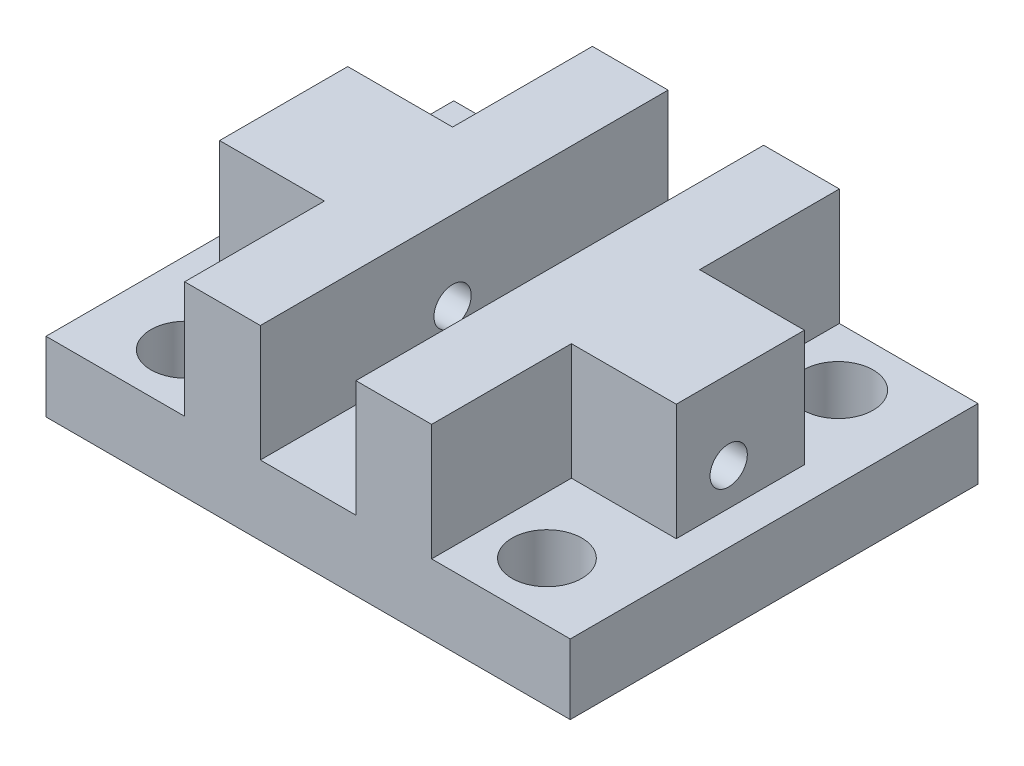
ISO-10303-21;
HEADER;
FILE_DESCRIPTION(('STEP AP214'),'2;1');
FILE_NAME('part.step','',(''),(''),'','','');
FILE_SCHEMA(('AUTOMOTIVE_DESIGN { 1 0 10303 214 1 1 1 1 }'));
ENDSEC;
DATA;
#1=APPLICATION_CONTEXT('core data for automotive mechanical design processes');
#2=APPLICATION_PROTOCOL_DEFINITION('international standard','automotive_design',2000,#1);
#3=PRODUCT_CONTEXT('',#1,'mechanical');
#4=PRODUCT('Part','Part','',(#3));
#5=PRODUCT_RELATED_PRODUCT_CATEGORY('part','',(#4));
#6=PRODUCT_DEFINITION_FORMATION('','',#4);
#7=PRODUCT_DEFINITION_CONTEXT('part definition',#1,'design');
#8=PRODUCT_DEFINITION('design','',#6,#7);
#9=PRODUCT_DEFINITION_SHAPE('','',#8);
#10=(LENGTH_UNIT() NAMED_UNIT(*) SI_UNIT(.MILLI.,.METRE.));
#11=(NAMED_UNIT(*) PLANE_ANGLE_UNIT() SI_UNIT($,.RADIAN.));
#12=(NAMED_UNIT(*) SI_UNIT($,.STERADIAN.) SOLID_ANGLE_UNIT());
#13=UNCERTAINTY_MEASURE_WITH_UNIT(LENGTH_MEASURE(1.E-05),#10,'distance_accuracy_value','');
#14=(GEOMETRIC_REPRESENTATION_CONTEXT(3) GLOBAL_UNCERTAINTY_ASSIGNED_CONTEXT((#13)) GLOBAL_UNIT_ASSIGNED_CONTEXT((#10,
#11,#12)) REPRESENTATION_CONTEXT('',''));
#15=CARTESIAN_POINT('',(0.,0.,0.));
#16=DIRECTION('',(0.,0.,1.));
#17=DIRECTION('',(1.,0.,0.));
#18=AXIS2_PLACEMENT_3D('',#15,#16,#17);
#19=CARTESIAN_POINT('',(0.,6.,0.));
#20=DIRECTION('',(0.,1.,0.));
#21=DIRECTION('',(0.,0.,1.));
#22=AXIS2_PLACEMENT_3D('',#19,#20,#21);
#23=PLANE('',#22);
#24=CARTESIAN_POINT('',(-15.5,6.,-13.5));
#25=DIRECTION('',(0.,1.,0.));
#26=DIRECTION('',(0.,0.,1.));
#27=AXIS2_PLACEMENT_3D('',#24,#25,#26);
#28=CIRCLE('',#27,3.);
#29=CARTESIAN_POINT('',(-15.5,6.,-10.5));
#30=VERTEX_POINT('',#29);
#31=EDGE_CURVE('E341',#30,#30,#28,.T.);
#32=ORIENTED_EDGE('',*,*,#31,.F.);
#33=EDGE_LOOP('',(#32));
#34=FACE_BOUND('',#33,.T.);
#35=CARTESIAN_POINT('',(-15.5,6.,11.5));
#36=DIRECTION('',(0.,1.,0.));
#37=DIRECTION('',(0.,0.,1.));
#38=AXIS2_PLACEMENT_3D('',#35,#36,#37);
#39=CIRCLE('',#38,3.);
#40=CARTESIAN_POINT('',(-15.5,6.,14.5));
#41=VERTEX_POINT('',#40);
#42=EDGE_CURVE('E342',#41,#41,#39,.T.);
#43=ORIENTED_EDGE('',*,*,#42,.F.);
#44=EDGE_LOOP('',(#43));
#45=FACE_BOUND('',#44,.T.);
#46=DIRECTION('',(0.,0.,-1.));
#47=VECTOR('',#46,1.);
#48=CARTESIAN_POINT('',(-19.6,6.,4.5));
#49=LINE('',#48,#47);
#50=CARTESIAN_POINT('',(-19.6,6.,4.5));
#51=VERTEX_POINT('',#50);
#52=CARTESIAN_POINT('',(-19.6,6.,-6.5));
#53=VERTEX_POINT('',#52);
#54=EDGE_CURVE('E57',#51,#53,#49,.T.);
#55=ORIENTED_EDGE('',*,*,#54,.T.);
#56=DIRECTION('',(1.,0.,0.));
#57=VECTOR('',#56,1.);
#58=CARTESIAN_POINT('',(-19.6,6.,-6.5));
#59=LINE('',#58,#57);
#60=CARTESIAN_POINT('',(-10.6,6.,-6.5));
#61=VERTEX_POINT('',#60);
#62=EDGE_CURVE('E204',#53,#61,#59,.T.);
#63=ORIENTED_EDGE('',*,*,#62,.T.);
#64=DIRECTION('',(0.,0.,-1.));
#65=VECTOR('',#64,1.);
#66=CARTESIAN_POINT('',(-10.6,6.,16.5));
#67=LINE('',#66,#65);
#68=CARTESIAN_POINT('',(-10.6,6.,-18.5));
#69=VERTEX_POINT('',#68);
#70=EDGE_CURVE('E292',#61,#69,#67,.T.);
#71=ORIENTED_EDGE('',*,*,#70,.T.);
#72=DIRECTION('',(-1.,0.,0.));
#73=VECTOR('',#72,1.);
#74=CARTESIAN_POINT('',(-22.5,6.,-18.5));
#75=LINE('',#74,#73);
#76=CARTESIAN_POINT('',(-22.5,6.,-18.5));
#77=VERTEX_POINT('',#76);
#78=EDGE_CURVE('E373',#69,#77,#75,.T.);
#79=ORIENTED_EDGE('',*,*,#78,.T.);
#80=DIRECTION('',(0.,0.,1.));
#81=VECTOR('',#80,1.);
#82=CARTESIAN_POINT('',(-22.5,6.,-18.5));
#83=LINE('',#82,#81);
#84=CARTESIAN_POINT('',(-22.5,6.,16.5));
#85=VERTEX_POINT('',#84);
#86=EDGE_CURVE('E362',#77,#85,#83,.T.);
#87=ORIENTED_EDGE('',*,*,#86,.T.);
#88=DIRECTION('',(1.,0.,0.));
#89=VECTOR('',#88,1.);
#90=CARTESIAN_POINT('',(-22.5,6.,16.5));
#91=LINE('',#90,#89);
#92=CARTESIAN_POINT('',(-10.6,6.,16.5));
#93=VERTEX_POINT('',#92);
#94=EDGE_CURVE('E367',#85,#93,#91,.T.);
#95=ORIENTED_EDGE('',*,*,#94,.T.);
#96=CARTESIAN_POINT('',(-10.6,6.,4.5));
#97=VERTEX_POINT('',#96);
#98=EDGE_CURVE('E293',#93,#97,#67,.T.);
#99=ORIENTED_EDGE('',*,*,#98,.T.);
#100=DIRECTION('',(1.,0.,0.));
#101=VECTOR('',#100,1.);
#102=CARTESIAN_POINT('',(-19.6,6.,4.5));
#103=LINE('',#102,#101);
#104=EDGE_CURVE('E53',#51,#97,#103,.T.);
#105=ORIENTED_EDGE('',*,*,#104,.F.);
#106=EDGE_LOOP('',(#55,#63,#71,#79,#87,#95,#99,#105));
#107=FACE_BOUND('',#106,.T.);
#108=ADVANCED_FACE('F35',(#34,#45,#107),#23,.T.);
#109=CARTESIAN_POINT('',(-10.6,0.,0.));
#110=DIRECTION('',(-1.,0.,0.));
#111=DIRECTION('',(0.,0.,1.));
#112=AXIS2_PLACEMENT_3D('',#109,#110,#111);
#113=PLANE('',#112);
#114=ORIENTED_EDGE('',*,*,#70,.F.);
#115=DIRECTION('',(0.,-1.,0.));
#116=VECTOR('',#115,1.);
#117=CARTESIAN_POINT('',(-10.6,16.,-6.5));
#118=LINE('',#117,#116);
#119=CARTESIAN_POINT('',(-10.6,16.,-6.5));
#120=VERTEX_POINT('',#119);
#121=EDGE_CURVE('E453',#120,#61,#118,.T.);
#122=ORIENTED_EDGE('',*,*,#121,.F.);
#123=DIRECTION('',(0.,0.,-1.));
#124=VECTOR('',#123,1.);
#125=CARTESIAN_POINT('',(-10.6,16.,16.5));
#126=LINE('',#125,#124);
#127=CARTESIAN_POINT('',(-10.6,16.,-18.5));
#128=VERTEX_POINT('',#127);
#129=EDGE_CURVE('E221',#120,#128,#126,.T.);
#130=ORIENTED_EDGE('',*,*,#129,.T.);
#131=DIRECTION('',(0.,1.,0.));
#132=VECTOR('',#131,1.);
#133=CARTESIAN_POINT('',(-10.6,6.,-18.5));
#134=LINE('',#133,#132);
#135=EDGE_CURVE('E289',#69,#128,#134,.T.);
#136=ORIENTED_EDGE('',*,*,#135,.F.);
#137=EDGE_LOOP('',(#114,#122,#130,#136));
#138=FACE_BOUND('',#137,.T.);
#139=ADVANCED_FACE('F452',(#138),#113,.T.);
#140=CARTESIAN_POINT('',(15.5,6.,11.5));
#141=DIRECTION('',(0.,1.,0.));
#142=DIRECTION('',(0.,0.,1.));
#143=AXIS2_PLACEMENT_3D('',#140,#141,#142);
#144=CIRCLE('',#143,3.);
#145=CARTESIAN_POINT('',(15.5,6.,14.5));
#146=VERTEX_POINT('',#145);
#147=EDGE_CURVE('E348',#146,#146,#144,.T.);
#148=ORIENTED_EDGE('',*,*,#147,.F.);
#149=EDGE_LOOP('',(#148));
#150=FACE_BOUND('',#149,.T.);
#151=CARTESIAN_POINT('',(15.5,6.,-13.5));
#152=DIRECTION('',(0.,1.,0.));
#153=DIRECTION('',(0.,0.,1.));
#154=AXIS2_PLACEMENT_3D('',#151,#152,#153);
#155=CIRCLE('',#154,3.);
#156=CARTESIAN_POINT('',(15.5,6.,-10.5));
#157=VERTEX_POINT('',#156);
#158=EDGE_CURVE('E329',#157,#157,#155,.T.);
#159=ORIENTED_EDGE('',*,*,#158,.F.);
#160=EDGE_LOOP('',(#159));
#161=FACE_BOUND('',#160,.T.);
#162=DIRECTION('',(0.,0.,-1.));
#163=VECTOR('',#162,1.);
#164=CARTESIAN_POINT('',(19.6,6.,4.49999999999999));
#165=LINE('',#164,#163);
#166=CARTESIAN_POINT('',(19.6,6.,4.49999999999999));
#167=VERTEX_POINT('',#166);
#168=CARTESIAN_POINT('',(19.6,6.,-6.50000000000001));
#169=VERTEX_POINT('',#168);
#170=EDGE_CURVE('E233',#167,#169,#165,.T.);
#171=ORIENTED_EDGE('',*,*,#170,.F.);
#172=DIRECTION('',(-1.,0.,0.));
#173=VECTOR('',#172,1.);
#174=CARTESIAN_POINT('',(19.6,6.,4.49999999999999));
#175=LINE('',#174,#173);
#176=CARTESIAN_POINT('',(10.6,6.,4.5));
#177=VERTEX_POINT('',#176);
#178=EDGE_CURVE('E251',#167,#177,#175,.T.);
#179=ORIENTED_EDGE('',*,*,#178,.T.);
#180=DIRECTION('',(0.,0.,1.));
#181=VECTOR('',#180,1.);
#182=CARTESIAN_POINT('',(10.6,6.,-18.5));
#183=LINE('',#182,#181);
#184=CARTESIAN_POINT('',(10.6,6.,16.5));
#185=VERTEX_POINT('',#184);
#186=EDGE_CURVE('E264',#177,#185,#183,.T.);
#187=ORIENTED_EDGE('',*,*,#186,.T.);
#188=CARTESIAN_POINT('',(22.5,6.,16.5));
#189=VERTEX_POINT('',#188);
#190=EDGE_CURVE('E365',#185,#189,#91,.T.);
#191=ORIENTED_EDGE('',*,*,#190,.T.);
#192=DIRECTION('',(0.,0.,-1.));
#193=VECTOR('',#192,1.);
#194=CARTESIAN_POINT('',(22.5,6.,-18.5));
#195=LINE('',#194,#193);
#196=CARTESIAN_POINT('',(22.5,6.,-18.5));
#197=VERTEX_POINT('',#196);
#198=EDGE_CURVE('E370',#189,#197,#195,.T.);
#199=ORIENTED_EDGE('',*,*,#198,.T.);
#200=CARTESIAN_POINT('',(10.6,6.,-18.5));
#201=VERTEX_POINT('',#200);
#202=EDGE_CURVE('E374',#197,#201,#75,.T.);
#203=ORIENTED_EDGE('',*,*,#202,.T.);
#204=CARTESIAN_POINT('',(10.6,6.,-6.50000000000001));
#205=VERTEX_POINT('',#204);
#206=EDGE_CURVE('E265',#201,#205,#183,.T.);
#207=ORIENTED_EDGE('',*,*,#206,.T.);
#208=DIRECTION('',(-1.,0.,0.));
#209=VECTOR('',#208,1.);
#210=CARTESIAN_POINT('',(19.6,6.,-6.50000000000001));
#211=LINE('',#210,#209);
#212=EDGE_CURVE('E248',#169,#205,#211,.T.);
#213=ORIENTED_EDGE('',*,*,#212,.F.);
#214=EDGE_LOOP('',(#171,#179,#187,#191,#199,#203,#207,#213));
#215=FACE_BOUND('',#214,.T.);
#216=ADVANCED_FACE('F416',(#150,#161,#215),#23,.T.);
#217=CARTESIAN_POINT('',(10.6,0.,0.));
#218=DIRECTION('',(1.,0.,0.));
#219=DIRECTION('',(0.,0.,-1.));
#220=AXIS2_PLACEMENT_3D('',#217,#218,#219);
#221=PLANE('',#220);
#222=ORIENTED_EDGE('',*,*,#186,.F.);
#223=DIRECTION('',(0.,-1.,0.));
#224=VECTOR('',#223,1.);
#225=CARTESIAN_POINT('',(10.6,16.,4.5));
#226=LINE('',#225,#224);
#227=CARTESIAN_POINT('',(10.6,16.,4.5));
#228=VERTEX_POINT('',#227);
#229=EDGE_CURVE('E222',#228,#177,#226,.T.);
#230=ORIENTED_EDGE('',*,*,#229,.F.);
#231=DIRECTION('',(0.,0.,1.));
#232=VECTOR('',#231,1.);
#233=CARTESIAN_POINT('',(10.6,16.,-18.5));
#234=LINE('',#233,#232);
#235=CARTESIAN_POINT('',(10.6,16.,16.5));
#236=VERTEX_POINT('',#235);
#237=EDGE_CURVE('E257',#228,#236,#234,.T.);
#238=ORIENTED_EDGE('',*,*,#237,.T.);
#239=DIRECTION('',(0.,1.,0.));
#240=VECTOR('',#239,1.);
#241=CARTESIAN_POINT('',(10.6,6.,16.5));
#242=LINE('',#241,#240);
#243=EDGE_CURVE('E261',#185,#236,#242,.T.);
#244=ORIENTED_EDGE('',*,*,#243,.F.);
#245=EDGE_LOOP('',(#222,#230,#238,#244));
#246=FACE_BOUND('',#245,.T.);
#247=ADVANCED_FACE('F502',(#246),#221,.T.);
#248=CARTESIAN_POINT('',(10.6,16.,-18.5));
#249=VERTEX_POINT('',#248);
#250=CARTESIAN_POINT('',(10.6,16.,-6.50000000000001));
#251=VERTEX_POINT('',#250);
#252=EDGE_CURVE('E259',#249,#251,#234,.T.);
#253=ORIENTED_EDGE('',*,*,#252,.T.);
#254=DIRECTION('',(0.,1.,0.));
#255=VECTOR('',#254,1.);
#256=CARTESIAN_POINT('',(10.6,16.,-6.50000000000001));
#257=LINE('',#256,#255);
#258=EDGE_CURVE('E225',#205,#251,#257,.T.);
#259=ORIENTED_EDGE('',*,*,#258,.F.);
#260=ORIENTED_EDGE('',*,*,#206,.F.);
#261=DIRECTION('',(0.,1.,0.));
#262=VECTOR('',#261,1.);
#263=CARTESIAN_POINT('',(10.6,6.,-18.5));
#264=LINE('',#263,#262);
#265=EDGE_CURVE('E254',#201,#249,#264,.T.);
#266=ORIENTED_EDGE('',*,*,#265,.T.);
#267=EDGE_LOOP('',(#253,#259,#260,#266));
#268=FACE_BOUND('',#267,.T.);
#269=ADVANCED_FACE('F500',(#268),#221,.T.);
#270=CARTESIAN_POINT('',(-4.1,6.,16.5));
#271=VERTEX_POINT('',#270);
#272=CARTESIAN_POINT('',(4.1,6.,16.5));
#273=VERTEX_POINT('',#272);
#274=EDGE_CURVE('E371',#271,#273,#91,.T.);
#275=ORIENTED_EDGE('',*,*,#274,.T.);
#276=DIRECTION('',(0.,0.,1.));
#277=VECTOR('',#276,1.);
#278=CARTESIAN_POINT('',(4.1,6.,-18.5));
#279=LINE('',#278,#277);
#280=CARTESIAN_POINT('',(4.1,6.,8.1));
#281=VERTEX_POINT('',#280);
#282=EDGE_CURVE('E277',#281,#273,#279,.T.);
#283=ORIENTED_EDGE('',*,*,#282,.F.);
#284=DIRECTION('',(1.,0.,0.));
#285=VECTOR('',#284,1.);
#286=CARTESIAN_POINT('',(-4.1,6.,8.1));
#287=LINE('',#286,#285);
#288=CARTESIAN_POINT('',(-4.1,6.,8.1));
#289=VERTEX_POINT('',#288);
#290=EDGE_CURVE('E307',#289,#281,#287,.T.);
#291=ORIENTED_EDGE('',*,*,#290,.F.);
#292=DIRECTION('',(0.,0.,-1.));
#293=VECTOR('',#292,1.);
#294=CARTESIAN_POINT('',(-4.1,6.,16.5));
#295=LINE('',#294,#293);
#296=EDGE_CURVE('E46',#271,#289,#295,.T.);
#297=ORIENTED_EDGE('',*,*,#296,.F.);
#298=EDGE_LOOP('',(#275,#283,#291,#297));
#299=FACE_BOUND('',#298,.T.);
#300=ADVANCED_FACE('F424',(#299),#23,.T.);
#301=DIRECTION('',(-1.,0.,0.));
#302=VECTOR('',#301,1.);
#303=CARTESIAN_POINT('',(-4.1,6.,-8.1));
#304=LINE('',#303,#302);
#305=CARTESIAN_POINT('',(4.1,6.,-8.1));
#306=VERTEX_POINT('',#305);
#307=CARTESIAN_POINT('',(-4.1,6.,-8.1));
#308=VERTEX_POINT('',#307);
#309=EDGE_CURVE('E312',#306,#308,#304,.T.);
#310=ORIENTED_EDGE('',*,*,#309,.F.);
#311=CARTESIAN_POINT('',(4.1,6.,-18.5));
#312=VERTEX_POINT('',#311);
#313=EDGE_CURVE('E258',#312,#306,#279,.T.);
#314=ORIENTED_EDGE('',*,*,#313,.F.);
#315=CARTESIAN_POINT('',(-4.1,6.,-18.5));
#316=VERTEX_POINT('',#315);
#317=EDGE_CURVE('E378',#312,#316,#75,.T.);
#318=ORIENTED_EDGE('',*,*,#317,.T.);
#319=EDGE_CURVE('E11',#308,#316,#295,.T.);
#320=ORIENTED_EDGE('',*,*,#319,.F.);
#321=EDGE_LOOP('',(#310,#314,#318,#320));
#322=FACE_BOUND('',#321,.T.);
#323=ADVANCED_FACE('F450',(#322),#23,.T.);
#324=CARTESIAN_POINT('',(-22.5,6.,-18.5));
#325=DIRECTION('',(1.,0.,0.));
#326=DIRECTION('',(0.,0.,-1.));
#327=AXIS2_PLACEMENT_3D('',#324,#325,#326);
#328=PLANE('',#327);
#329=DIRECTION('',(0.,0.,1.));
#330=VECTOR('',#329,1.);
#331=CARTESIAN_POINT('',(-22.5,0.,-18.5));
#332=LINE('',#331,#330);
#333=CARTESIAN_POINT('',(-22.5,0.,-18.5));
#334=VERTEX_POINT('',#333);
#335=CARTESIAN_POINT('',(-22.5,0.,16.5));
#336=VERTEX_POINT('',#335);
#337=EDGE_CURVE('E359',#334,#336,#332,.T.);
#338=ORIENTED_EDGE('',*,*,#337,.T.);
#339=DIRECTION('',(0.,-1.,0.));
#340=VECTOR('',#339,1.);
#341=CARTESIAN_POINT('',(-22.5,6.,16.5));
#342=LINE('',#341,#340);
#343=EDGE_CURVE('E44',#85,#336,#342,.T.);
#344=ORIENTED_EDGE('',*,*,#343,.F.);
#345=ORIENTED_EDGE('',*,*,#86,.F.);
#346=DIRECTION('',(0.,-1.,0.));
#347=VECTOR('',#346,1.);
#348=CARTESIAN_POINT('',(-22.5,6.,-18.5));
#349=LINE('',#348,#347);
#350=EDGE_CURVE('E377',#77,#334,#349,.T.);
#351=ORIENTED_EDGE('',*,*,#350,.T.);
#352=EDGE_LOOP('',(#338,#344,#345,#351));
#353=FACE_BOUND('',#352,.T.);
#354=ADVANCED_FACE('F37',(#353),#328,.F.);
#355=CARTESIAN_POINT('',(-22.5,6.,16.5));
#356=DIRECTION('',(0.,0.,-1.));
#357=DIRECTION('',(-1.,0.,0.));
#358=AXIS2_PLACEMENT_3D('',#355,#356,#357);
#359=PLANE('',#358);
#360=DIRECTION('',(1.,0.,0.));
#361=VECTOR('',#360,1.);
#362=CARTESIAN_POINT('',(-22.5,0.,16.5));
#363=LINE('',#362,#361);
#364=CARTESIAN_POINT('',(22.5,0.,16.5));
#365=VERTEX_POINT('',#364);
#366=EDGE_CURVE('E381',#336,#365,#363,.T.);
#367=ORIENTED_EDGE('',*,*,#366,.T.);
#368=DIRECTION('',(0.,-1.,0.));
#369=VECTOR('',#368,1.);
#370=CARTESIAN_POINT('',(22.5,6.,16.5));
#371=LINE('',#370,#369);
#372=EDGE_CURVE('E391',#189,#365,#371,.T.);
#373=ORIENTED_EDGE('',*,*,#372,.F.);
#374=ORIENTED_EDGE('',*,*,#190,.F.);
#375=ORIENTED_EDGE('',*,*,#243,.T.);
#376=DIRECTION('',(-1.,0.,0.));
#377=VECTOR('',#376,1.);
#378=CARTESIAN_POINT('',(10.6,16.,16.5));
#379=LINE('',#378,#377);
#380=CARTESIAN_POINT('',(4.1,16.,16.5));
#381=VERTEX_POINT('',#380);
#382=EDGE_CURVE('E268',#236,#381,#379,.T.);
#383=ORIENTED_EDGE('',*,*,#382,.T.);
#384=DIRECTION('',(0.,1.,0.));
#385=VECTOR('',#384,1.);
#386=CARTESIAN_POINT('',(4.1,6.,16.5));
#387=LINE('',#386,#385);
#388=EDGE_CURVE('E274',#273,#381,#387,.T.);
#389=ORIENTED_EDGE('',*,*,#388,.F.);
#390=ORIENTED_EDGE('',*,*,#274,.F.);
#391=DIRECTION('',(0.,1.,0.));
#392=VECTOR('',#391,1.);
#393=CARTESIAN_POINT('',(-4.1,6.,16.5));
#394=LINE('',#393,#392);
#395=CARTESIAN_POINT('',(-4.1,16.,16.5));
#396=VERTEX_POINT('',#395);
#397=EDGE_CURVE('E283',#271,#396,#394,.T.);
#398=ORIENTED_EDGE('',*,*,#397,.T.);
#399=DIRECTION('',(1.,0.,0.));
#400=VECTOR('',#399,1.);
#401=CARTESIAN_POINT('',(-10.6,16.,16.5));
#402=LINE('',#401,#400);
#403=CARTESIAN_POINT('',(-10.6,16.,16.5));
#404=VERTEX_POINT('',#403);
#405=EDGE_CURVE('E304',#404,#396,#402,.T.);
#406=ORIENTED_EDGE('',*,*,#405,.F.);
#407=DIRECTION('',(0.,1.,0.));
#408=VECTOR('',#407,1.);
#409=CARTESIAN_POINT('',(-10.6,6.,16.5));
#410=LINE('',#409,#408);
#411=EDGE_CURVE('E284',#93,#404,#410,.T.);
#412=ORIENTED_EDGE('',*,*,#411,.F.);
#413=ORIENTED_EDGE('',*,*,#94,.F.);
#414=ORIENTED_EDGE('',*,*,#343,.T.);
#415=EDGE_LOOP('',(#367,#373,#374,#375,#383,#389,#390,#398,#406,#412,#413,#414));
#416=FACE_BOUND('',#415,.T.);
#417=ADVANCED_FACE('F396',(#416),#359,.F.);
#418=CARTESIAN_POINT('',(22.5,6.,-18.5));
#419=DIRECTION('',(-1.,0.,0.));
#420=DIRECTION('',(0.,0.,1.));
#421=AXIS2_PLACEMENT_3D('',#418,#419,#420);
#422=PLANE('',#421);
#423=DIRECTION('',(0.,0.,-1.));
#424=VECTOR('',#423,1.);
#425=CARTESIAN_POINT('',(22.5,0.,-18.5));
#426=LINE('',#425,#424);
#427=CARTESIAN_POINT('',(22.5,0.,-18.5));
#428=VERTEX_POINT('',#427);
#429=EDGE_CURVE('E383',#365,#428,#426,.T.);
#430=ORIENTED_EDGE('',*,*,#429,.T.);
#431=DIRECTION('',(0.,-1.,0.));
#432=VECTOR('',#431,1.);
#433=CARTESIAN_POINT('',(22.5,6.,-18.5));
#434=LINE('',#433,#432);
#435=EDGE_CURVE('E388',#197,#428,#434,.T.);
#436=ORIENTED_EDGE('',*,*,#435,.F.);
#437=ORIENTED_EDGE('',*,*,#198,.F.);
#438=ORIENTED_EDGE('',*,*,#372,.T.);
#439=EDGE_LOOP('',(#430,#436,#437,#438));
#440=FACE_BOUND('',#439,.T.);
#441=ADVANCED_FACE('F408',(#440),#422,.F.);
#442=CARTESIAN_POINT('',(-22.5,6.,-18.5));
#443=DIRECTION('',(0.,0.,1.));
#444=DIRECTION('',(1.,0.,0.));
#445=AXIS2_PLACEMENT_3D('',#442,#443,#444);
#446=PLANE('',#445);
#447=DIRECTION('',(-1.,0.,0.));
#448=VECTOR('',#447,1.);
#449=CARTESIAN_POINT('',(-22.5,0.,-18.5));
#450=LINE('',#449,#448);
#451=EDGE_CURVE('E366',#428,#334,#450,.T.);
#452=ORIENTED_EDGE('',*,*,#451,.T.);
#453=ORIENTED_EDGE('',*,*,#350,.F.);
#454=ORIENTED_EDGE('',*,*,#78,.F.);
#455=ORIENTED_EDGE('',*,*,#135,.T.);
#456=DIRECTION('',(1.,0.,0.));
#457=VECTOR('',#456,1.);
#458=CARTESIAN_POINT('',(-10.6,16.,-18.5));
#459=LINE('',#458,#457);
#460=CARTESIAN_POINT('',(-4.1,16.,-18.5));
#461=VERTEX_POINT('',#460);
#462=EDGE_CURVE('E295',#128,#461,#459,.T.);
#463=ORIENTED_EDGE('',*,*,#462,.T.);
#464=DIRECTION('',(0.,1.,0.));
#465=VECTOR('',#464,1.);
#466=CARTESIAN_POINT('',(-4.1,6.,-18.5));
#467=LINE('',#466,#465);
#468=EDGE_CURVE('E300',#316,#461,#467,.T.);
#469=ORIENTED_EDGE('',*,*,#468,.F.);
#470=ORIENTED_EDGE('',*,*,#317,.F.);
#471=DIRECTION('',(0.,1.,0.));
#472=VECTOR('',#471,1.);
#473=CARTESIAN_POINT('',(4.1,6.,-18.5));
#474=LINE('',#473,#472);
#475=CARTESIAN_POINT('',(4.1,16.,-18.5));
#476=VERTEX_POINT('',#475);
#477=EDGE_CURVE('E253',#312,#476,#474,.T.);
#478=ORIENTED_EDGE('',*,*,#477,.T.);
#479=DIRECTION('',(-1.,0.,0.));
#480=VECTOR('',#479,1.);
#481=CARTESIAN_POINT('',(10.6,16.,-18.5));
#482=LINE('',#481,#480);
#483=EDGE_CURVE('E280',#249,#476,#482,.T.);
#484=ORIENTED_EDGE('',*,*,#483,.F.);
#485=ORIENTED_EDGE('',*,*,#265,.F.);
#486=ORIENTED_EDGE('',*,*,#202,.F.);
#487=ORIENTED_EDGE('',*,*,#435,.T.);
#488=EDGE_LOOP('',(#452,#453,#454,#455,#463,#469,#470,#478,#484,#485,#486,#487));
#489=FACE_BOUND('',#488,.T.);
#490=ADVANCED_FACE('F412',(#489),#446,.F.);
#491=CARTESIAN_POINT('',(0.,0.,0.));
#492=DIRECTION('',(0.,1.,0.));
#493=DIRECTION('',(0.,0.,1.));
#494=AXIS2_PLACEMENT_3D('',#491,#492,#493);
#495=PLANE('',#494);
#496=DIRECTION('',(-1.,0.,0.));
#497=VECTOR('',#496,1.);
#498=CARTESIAN_POINT('',(-4.1,0.,-8.1));
#499=LINE('',#498,#497);
#500=CARTESIAN_POINT('',(4.1,0.,-8.1));
#501=VERTEX_POINT('',#500);
#502=CARTESIAN_POINT('',(-4.1,0.,-8.1));
#503=VERTEX_POINT('',#502);
#504=EDGE_CURVE('E318',#501,#503,#499,.T.);
#505=ORIENTED_EDGE('',*,*,#504,.T.);
#506=DIRECTION('',(0.,0.,1.));
#507=VECTOR('',#506,1.);
#508=CARTESIAN_POINT('',(-4.1,0.,-8.1));
#509=LINE('',#508,#507);
#510=CARTESIAN_POINT('',(-4.1,0.,8.1));
#511=VERTEX_POINT('',#510);
#512=EDGE_CURVE('E308',#503,#511,#509,.T.);
#513=ORIENTED_EDGE('',*,*,#512,.T.);
#514=DIRECTION('',(1.,0.,0.));
#515=VECTOR('',#514,1.);
#516=CARTESIAN_POINT('',(-4.1,0.,8.1));
#517=LINE('',#516,#515);
#518=CARTESIAN_POINT('',(4.1,0.,8.1));
#519=VERTEX_POINT('',#518);
#520=EDGE_CURVE('E311',#511,#519,#517,.T.);
#521=ORIENTED_EDGE('',*,*,#520,.T.);
#522=DIRECTION('',(0.,0.,-1.));
#523=VECTOR('',#522,1.);
#524=CARTESIAN_POINT('',(4.1,0.,-8.1));
#525=LINE('',#524,#523);
#526=EDGE_CURVE('E315',#519,#501,#525,.T.);
#527=ORIENTED_EDGE('',*,*,#526,.T.);
#528=EDGE_LOOP('',(#505,#513,#521,#527));
#529=FACE_BOUND('',#528,.T.);
#530=CARTESIAN_POINT('',(-15.5,0.,11.5));
#531=DIRECTION('',(0.,1.,0.));
#532=DIRECTION('',(0.,0.,1.));
#533=AXIS2_PLACEMENT_3D('',#530,#531,#532);
#534=CIRCLE('',#533,3.);
#535=CARTESIAN_POINT('',(-15.5,0.,14.5));
#536=VERTEX_POINT('',#535);
#537=EDGE_CURVE('E338',#536,#536,#534,.T.);
#538=ORIENTED_EDGE('',*,*,#537,.T.);
#539=EDGE_LOOP('',(#538));
#540=FACE_BOUND('',#539,.T.);
#541=CARTESIAN_POINT('',(15.5,0.,11.5));
#542=DIRECTION('',(0.,1.,0.));
#543=DIRECTION('',(0.,0.,1.));
#544=AXIS2_PLACEMENT_3D('',#541,#542,#543);
#545=CIRCLE('',#544,3.);
#546=CARTESIAN_POINT('',(15.5,0.,14.5));
#547=VERTEX_POINT('',#546);
#548=EDGE_CURVE('E345',#547,#547,#545,.T.);
#549=ORIENTED_EDGE('',*,*,#548,.T.);
#550=EDGE_LOOP('',(#549));
#551=FACE_BOUND('',#550,.T.);
#552=CARTESIAN_POINT('',(15.5,0.,-13.5));
#553=DIRECTION('',(0.,1.,0.));
#554=DIRECTION('',(0.,0.,1.));
#555=AXIS2_PLACEMENT_3D('',#552,#553,#554);
#556=CIRCLE('',#555,3.);
#557=CARTESIAN_POINT('',(15.5,0.,-10.5));
#558=VERTEX_POINT('',#557);
#559=EDGE_CURVE('E351',#558,#558,#556,.T.);
#560=ORIENTED_EDGE('',*,*,#559,.T.);
#561=EDGE_LOOP('',(#560));
#562=FACE_BOUND('',#561,.T.);
#563=CARTESIAN_POINT('',(-15.5,0.,-13.5));
#564=DIRECTION('',(0.,1.,0.));
#565=DIRECTION('',(0.,0.,1.));
#566=AXIS2_PLACEMENT_3D('',#563,#564,#565);
#567=CIRCLE('',#566,3.);
#568=CARTESIAN_POINT('',(-15.5,0.,-10.5));
#569=VERTEX_POINT('',#568);
#570=EDGE_CURVE('E356',#569,#569,#567,.T.);
#571=ORIENTED_EDGE('',*,*,#570,.T.);
#572=EDGE_LOOP('',(#571));
#573=FACE_BOUND('',#572,.T.);
#574=ORIENTED_EDGE('',*,*,#337,.F.);
#575=ORIENTED_EDGE('',*,*,#451,.F.);
#576=ORIENTED_EDGE('',*,*,#429,.F.);
#577=ORIENTED_EDGE('',*,*,#366,.F.);
#578=EDGE_LOOP('',(#574,#575,#576,#577));
#579=FACE_BOUND('',#578,.T.);
#580=ADVANCED_FACE('F404',(#529,#540,#551,#562,#573,#579),#495,.F.);
#581=CARTESIAN_POINT('',(-15.5,0.,-13.5));
#582=DIRECTION('',(0.,1.,0.));
#583=DIRECTION('',(0.,0.,1.));
#584=AXIS2_PLACEMENT_3D('',#581,#582,#583);
#585=CYLINDRICAL_SURFACE('',#584,3.);
#586=ORIENTED_EDGE('',*,*,#570,.F.);
#587=EDGE_LOOP('',(#586));
#588=FACE_BOUND('',#587,.T.);
#589=ORIENTED_EDGE('',*,*,#31,.T.);
#590=EDGE_LOOP('',(#589));
#591=FACE_BOUND('',#590,.T.);
#592=ADVANCED_FACE('F525',(#588,#591),#585,.F.);
#593=CARTESIAN_POINT('',(15.5,0.,-13.5));
#594=DIRECTION('',(0.,1.,0.));
#595=DIRECTION('',(0.,0.,1.));
#596=AXIS2_PLACEMENT_3D('',#593,#594,#595);
#597=CYLINDRICAL_SURFACE('',#596,3.);
#598=ORIENTED_EDGE('',*,*,#559,.F.);
#599=EDGE_LOOP('',(#598));
#600=FACE_BOUND('',#599,.T.);
#601=ORIENTED_EDGE('',*,*,#158,.T.);
#602=EDGE_LOOP('',(#601));
#603=FACE_BOUND('',#602,.T.);
#604=ADVANCED_FACE('F530',(#600,#603),#597,.F.);
#605=CARTESIAN_POINT('',(15.5,0.,11.5));
#606=DIRECTION('',(0.,1.,0.));
#607=DIRECTION('',(0.,0.,1.));
#608=AXIS2_PLACEMENT_3D('',#605,#606,#607);
#609=CYLINDRICAL_SURFACE('',#608,3.);
#610=ORIENTED_EDGE('',*,*,#548,.F.);
#611=EDGE_LOOP('',(#610));
#612=FACE_BOUND('',#611,.T.);
#613=ORIENTED_EDGE('',*,*,#147,.T.);
#614=EDGE_LOOP('',(#613));
#615=FACE_BOUND('',#614,.T.);
#616=ADVANCED_FACE('F545',(#612,#615),#609,.F.);
#617=CARTESIAN_POINT('',(-15.5,0.,11.5));
#618=DIRECTION('',(0.,1.,0.));
#619=DIRECTION('',(0.,0.,1.));
#620=AXIS2_PLACEMENT_3D('',#617,#618,#619);
#621=CYLINDRICAL_SURFACE('',#620,3.);
#622=ORIENTED_EDGE('',*,*,#537,.F.);
#623=EDGE_LOOP('',(#622));
#624=FACE_BOUND('',#623,.T.);
#625=ORIENTED_EDGE('',*,*,#42,.T.);
#626=EDGE_LOOP('',(#625));
#627=FACE_BOUND('',#626,.T.);
#628=ADVANCED_FACE('F551',(#624,#627),#621,.F.);
#629=CARTESIAN_POINT('',(-4.1,0.,-8.1));
#630=DIRECTION('',(-1.,0.,0.));
#631=DIRECTION('',(0.,0.,1.));
#632=AXIS2_PLACEMENT_3D('',#629,#630,#631);
#633=PLANE('',#632);
#634=CARTESIAN_POINT('',(-4.1,9.2,0.));
#635=DIRECTION('',(-1.,0.,0.));
#636=DIRECTION('',(0.,0.,1.));
#637=AXIS2_PLACEMENT_3D('',#634,#635,#636);
#638=CIRCLE('',#637,1.6);
#639=CARTESIAN_POINT('',(-4.1,9.2,1.59999999999999));
#640=VERTEX_POINT('',#639);
#641=EDGE_CURVE('E454',#640,#640,#638,.T.);
#642=ORIENTED_EDGE('',*,*,#641,.T.);
#643=EDGE_LOOP('',(#642));
#644=FACE_BOUND('',#643,.T.);
#645=DIRECTION('',(0.,1.,0.));
#646=VECTOR('',#645,1.);
#647=CARTESIAN_POINT('',(-4.1,0.,-8.1));
#648=LINE('',#647,#646);
#649=EDGE_CURVE('E326',#503,#308,#648,.T.);
#650=ORIENTED_EDGE('',*,*,#649,.T.);
#651=ORIENTED_EDGE('',*,*,#319,.T.);
#652=ORIENTED_EDGE('',*,*,#468,.T.);
#653=DIRECTION('',(0.,0.,-1.));
#654=VECTOR('',#653,1.);
#655=CARTESIAN_POINT('',(-4.1,16.,16.5));
#656=LINE('',#655,#654);
#657=EDGE_CURVE('E298',#396,#461,#656,.T.);
#658=ORIENTED_EDGE('',*,*,#657,.F.);
#659=ORIENTED_EDGE('',*,*,#397,.F.);
#660=ORIENTED_EDGE('',*,*,#296,.T.);
#661=DIRECTION('',(0.,1.,0.));
#662=VECTOR('',#661,1.);
#663=CARTESIAN_POINT('',(-4.1,0.,8.1));
#664=LINE('',#663,#662);
#665=EDGE_CURVE('E321',#511,#289,#664,.T.);
#666=ORIENTED_EDGE('',*,*,#665,.F.);
#667=ORIENTED_EDGE('',*,*,#512,.F.);
#668=EDGE_LOOP('',(#650,#651,#652,#658,#659,#660,#666,#667));
#669=FACE_BOUND('',#668,.T.);
#670=ADVANCED_FACE('F437',(#644,#669),#633,.F.);
#671=CARTESIAN_POINT('',(-4.1,0.,-8.1));
#672=DIRECTION('',(0.,0.,-1.));
#673=DIRECTION('',(-1.,0.,0.));
#674=AXIS2_PLACEMENT_3D('',#671,#672,#673);
#675=PLANE('',#674);
#676=ORIENTED_EDGE('',*,*,#309,.T.);
#677=ORIENTED_EDGE('',*,*,#649,.F.);
#678=ORIENTED_EDGE('',*,*,#504,.F.);
#679=DIRECTION('',(0.,1.,0.));
#680=VECTOR('',#679,1.);
#681=CARTESIAN_POINT('',(4.1,0.,-8.1));
#682=LINE('',#681,#680);
#683=EDGE_CURVE('E330',#501,#306,#682,.T.);
#684=ORIENTED_EDGE('',*,*,#683,.T.);
#685=EDGE_LOOP('',(#676,#677,#678,#684));
#686=FACE_BOUND('',#685,.T.);
#687=ADVANCED_FACE('F560',(#686),#675,.F.);
#688=CARTESIAN_POINT('',(4.1,0.,-8.1));
#689=DIRECTION('',(1.,0.,0.));
#690=DIRECTION('',(0.,0.,-1.));
#691=AXIS2_PLACEMENT_3D('',#688,#689,#690);
#692=PLANE('',#691);
#693=CARTESIAN_POINT('',(4.1,9.2,0.));
#694=DIRECTION('',(1.,0.,0.));
#695=DIRECTION('',(0.,0.,-1.));
#696=AXIS2_PLACEMENT_3D('',#693,#694,#695);
#697=CIRCLE('',#696,1.6);
#698=CARTESIAN_POINT('',(4.1,9.2,-1.60000000000001));
#699=VERTEX_POINT('',#698);
#700=EDGE_CURVE('E458',#699,#699,#697,.T.);
#701=ORIENTED_EDGE('',*,*,#700,.T.);
#702=EDGE_LOOP('',(#701));
#703=FACE_BOUND('',#702,.T.);
#704=DIRECTION('',(0.,1.,0.));
#705=VECTOR('',#704,1.);
#706=CARTESIAN_POINT('',(4.1,0.,8.1));
#707=LINE('',#706,#705);
#708=EDGE_CURVE('E333',#519,#281,#707,.T.);
#709=ORIENTED_EDGE('',*,*,#708,.T.);
#710=ORIENTED_EDGE('',*,*,#282,.T.);
#711=ORIENTED_EDGE('',*,*,#388,.T.);
#712=DIRECTION('',(0.,0.,1.));
#713=VECTOR('',#712,1.);
#714=CARTESIAN_POINT('',(4.1,16.,-18.5));
#715=LINE('',#714,#713);
#716=EDGE_CURVE('E271',#476,#381,#715,.T.);
#717=ORIENTED_EDGE('',*,*,#716,.F.);
#718=ORIENTED_EDGE('',*,*,#477,.F.);
#719=ORIENTED_EDGE('',*,*,#313,.T.);
#720=ORIENTED_EDGE('',*,*,#683,.F.);
#721=ORIENTED_EDGE('',*,*,#526,.F.);
#722=EDGE_LOOP('',(#709,#710,#711,#717,#718,#719,#720,#721));
#723=FACE_BOUND('',#722,.T.);
#724=ADVANCED_FACE('F430',(#703,#723),#692,.F.);
#725=CARTESIAN_POINT('',(-4.1,0.,8.1));
#726=DIRECTION('',(0.,0.,1.));
#727=DIRECTION('',(1.,0.,0.));
#728=AXIS2_PLACEMENT_3D('',#725,#726,#727);
#729=PLANE('',#728);
#730=ORIENTED_EDGE('',*,*,#290,.T.);
#731=ORIENTED_EDGE('',*,*,#708,.F.);
#732=ORIENTED_EDGE('',*,*,#520,.F.);
#733=ORIENTED_EDGE('',*,*,#665,.T.);
#734=EDGE_LOOP('',(#730,#731,#732,#733));
#735=FACE_BOUND('',#734,.T.);
#736=ADVANCED_FACE('F434',(#735),#729,.F.);
#737=CARTESIAN_POINT('',(-10.6,16.,16.5));
#738=DIRECTION('',(0.,-1.,0.));
#739=DIRECTION('',(0.,0.,-1.));
#740=AXIS2_PLACEMENT_3D('',#737,#738,#739);
#741=PLANE('',#740);
#742=ORIENTED_EDGE('',*,*,#657,.T.);
#743=ORIENTED_EDGE('',*,*,#462,.F.);
#744=ORIENTED_EDGE('',*,*,#129,.F.);
#745=DIRECTION('',(1.,0.,0.));
#746=VECTOR('',#745,1.);
#747=CARTESIAN_POINT('',(-19.6,16.,-6.5));
#748=LINE('',#747,#746);
#749=CARTESIAN_POINT('',(-19.6,16.,-6.5));
#750=VERTEX_POINT('',#749);
#751=EDGE_CURVE('E203',#750,#120,#748,.T.);
#752=ORIENTED_EDGE('',*,*,#751,.F.);
#753=DIRECTION('',(0.,0.,-1.));
#754=VECTOR('',#753,1.);
#755=CARTESIAN_POINT('',(-19.6,16.,4.5));
#756=LINE('',#755,#754);
#757=CARTESIAN_POINT('',(-19.6,16.,4.5));
#758=VERTEX_POINT('',#757);
#759=EDGE_CURVE('E206',#758,#750,#756,.T.);
#760=ORIENTED_EDGE('',*,*,#759,.F.);
#761=DIRECTION('',(1.,0.,0.));
#762=VECTOR('',#761,1.);
#763=CARTESIAN_POINT('',(-19.6,16.,4.5));
#764=LINE('',#763,#762);
#765=CARTESIAN_POINT('',(-10.6,16.,4.5));
#766=VERTEX_POINT('',#765);
#767=EDGE_CURVE('E463',#758,#766,#764,.T.);
#768=ORIENTED_EDGE('',*,*,#767,.T.);
#769=EDGE_CURVE('E287',#404,#766,#126,.T.);
#770=ORIENTED_EDGE('',*,*,#769,.F.);
#771=ORIENTED_EDGE('',*,*,#405,.T.);
#772=EDGE_LOOP('',(#742,#743,#744,#752,#760,#768,#770,#771));
#773=FACE_BOUND('',#772,.T.);
#774=ADVANCED_FACE('F219',(#773),#741,.F.);
#775=DIRECTION('',(0.,-1.,0.));
#776=VECTOR('',#775,1.);
#777=CARTESIAN_POINT('',(-10.6,16.,4.5));
#778=LINE('',#777,#776);
#779=EDGE_CURVE('E215',#766,#97,#778,.T.);
#780=ORIENTED_EDGE('',*,*,#779,.T.);
#781=ORIENTED_EDGE('',*,*,#98,.F.);
#782=ORIENTED_EDGE('',*,*,#411,.T.);
#783=ORIENTED_EDGE('',*,*,#769,.T.);
#784=EDGE_LOOP('',(#780,#781,#782,#783));
#785=FACE_BOUND('',#784,.T.);
#786=ADVANCED_FACE('F441',(#785),#113,.T.);
#787=CARTESIAN_POINT('',(10.6,16.,-18.5));
#788=DIRECTION('',(0.,-1.,0.));
#789=DIRECTION('',(0.,0.,-1.));
#790=AXIS2_PLACEMENT_3D('',#787,#788,#789);
#791=PLANE('',#790);
#792=ORIENTED_EDGE('',*,*,#716,.T.);
#793=ORIENTED_EDGE('',*,*,#382,.F.);
#794=ORIENTED_EDGE('',*,*,#237,.F.);
#795=DIRECTION('',(-1.,0.,0.));
#796=VECTOR('',#795,1.);
#797=CARTESIAN_POINT('',(19.6,16.,4.49999999999999));
#798=LINE('',#797,#796);
#799=CARTESIAN_POINT('',(19.6,16.,4.49999999999999));
#800=VERTEX_POINT('',#799);
#801=EDGE_CURVE('E239',#800,#228,#798,.T.);
#802=ORIENTED_EDGE('',*,*,#801,.F.);
#803=DIRECTION('',(0.,0.,1.));
#804=VECTOR('',#803,1.);
#805=CARTESIAN_POINT('',(19.6,16.,4.49999999999999));
#806=LINE('',#805,#804);
#807=CARTESIAN_POINT('',(19.6,16.,-6.50000000000001));
#808=VERTEX_POINT('',#807);
#809=EDGE_CURVE('E238',#808,#800,#806,.T.);
#810=ORIENTED_EDGE('',*,*,#809,.F.);
#811=DIRECTION('',(-1.,0.,0.));
#812=VECTOR('',#811,1.);
#813=CARTESIAN_POINT('',(19.6,16.,-6.50000000000001));
#814=LINE('',#813,#812);
#815=EDGE_CURVE('E245',#808,#251,#814,.T.);
#816=ORIENTED_EDGE('',*,*,#815,.T.);
#817=ORIENTED_EDGE('',*,*,#252,.F.);
#818=ORIENTED_EDGE('',*,*,#483,.T.);
#819=EDGE_LOOP('',(#792,#793,#794,#802,#810,#816,#817,#818));
#820=FACE_BOUND('',#819,.T.);
#821=ADVANCED_FACE('F573',(#820),#791,.F.);
#822=CARTESIAN_POINT('',(19.6,16.,4.49999999999999));
#823=DIRECTION('',(0.,0.,-1.));
#824=DIRECTION('',(-1.,0.,0.));
#825=AXIS2_PLACEMENT_3D('',#822,#823,#824);
#826=PLANE('',#825);
#827=ORIENTED_EDGE('',*,*,#229,.T.);
#828=ORIENTED_EDGE('',*,*,#178,.F.);
#829=DIRECTION('',(0.,-1.,0.));
#830=VECTOR('',#829,1.);
#831=CARTESIAN_POINT('',(19.6,16.,4.49999999999999));
#832=LINE('',#831,#830);
#833=EDGE_CURVE('E230',#800,#167,#832,.T.);
#834=ORIENTED_EDGE('',*,*,#833,.F.);
#835=ORIENTED_EDGE('',*,*,#801,.T.);
#836=EDGE_LOOP('',(#827,#828,#834,#835));
#837=FACE_BOUND('',#836,.T.);
#838=ADVANCED_FACE('F575',(#837),#826,.F.);
#839=CARTESIAN_POINT('',(19.6,16.,-6.50000000000001));
#840=DIRECTION('',(0.,0.,1.));
#841=DIRECTION('',(1.,0.,0.));
#842=AXIS2_PLACEMENT_3D('',#839,#840,#841);
#843=PLANE('',#842);
#844=ORIENTED_EDGE('',*,*,#258,.T.);
#845=ORIENTED_EDGE('',*,*,#815,.F.);
#846=DIRECTION('',(0.,1.,0.));
#847=VECTOR('',#846,1.);
#848=CARTESIAN_POINT('',(19.6,16.,-6.50000000000001));
#849=LINE('',#848,#847);
#850=EDGE_CURVE('E236',#169,#808,#849,.T.);
#851=ORIENTED_EDGE('',*,*,#850,.F.);
#852=ORIENTED_EDGE('',*,*,#212,.T.);
#853=EDGE_LOOP('',(#844,#845,#851,#852));
#854=FACE_BOUND('',#853,.T.);
#855=ADVANCED_FACE('F580',(#854),#843,.F.);
#856=CARTESIAN_POINT('',(19.6,0.,0.));
#857=DIRECTION('',(1.,0.,0.));
#858=DIRECTION('',(0.,0.,-1.));
#859=AXIS2_PLACEMENT_3D('',#856,#857,#858);
#860=PLANE('',#859);
#861=CARTESIAN_POINT('',(19.6,9.2,0.));
#862=DIRECTION('',(1.,0.,0.));
#863=DIRECTION('',(0.,0.,-1.));
#864=AXIS2_PLACEMENT_3D('',#861,#862,#863);
#865=CIRCLE('',#864,1.6);
#866=CARTESIAN_POINT('',(19.6,9.2,-1.60000000000001));
#867=VERTEX_POINT('',#866);
#868=EDGE_CURVE('E469',#867,#867,#865,.T.);
#869=ORIENTED_EDGE('',*,*,#868,.F.);
#870=EDGE_LOOP('',(#869));
#871=FACE_BOUND('',#870,.T.);
#872=ORIENTED_EDGE('',*,*,#833,.T.);
#873=ORIENTED_EDGE('',*,*,#170,.T.);
#874=ORIENTED_EDGE('',*,*,#850,.T.);
#875=ORIENTED_EDGE('',*,*,#809,.T.);
#876=EDGE_LOOP('',(#872,#873,#874,#875));
#877=FACE_BOUND('',#876,.T.);
#878=ADVANCED_FACE('F584',(#871,#877),#860,.T.);
#879=CARTESIAN_POINT('',(-19.6,16.,-6.5));
#880=DIRECTION('',(0.,0.,1.));
#881=DIRECTION('',(1.,0.,0.));
#882=AXIS2_PLACEMENT_3D('',#879,#880,#881);
#883=PLANE('',#882);
#884=ORIENTED_EDGE('',*,*,#121,.T.);
#885=ORIENTED_EDGE('',*,*,#62,.F.);
#886=DIRECTION('',(0.,-1.,0.));
#887=VECTOR('',#886,1.);
#888=CARTESIAN_POINT('',(-19.6,16.,-6.5));
#889=LINE('',#888,#887);
#890=EDGE_CURVE('E198',#750,#53,#889,.T.);
#891=ORIENTED_EDGE('',*,*,#890,.F.);
#892=ORIENTED_EDGE('',*,*,#751,.T.);
#893=EDGE_LOOP('',(#884,#885,#891,#892));
#894=FACE_BOUND('',#893,.T.);
#895=ADVANCED_FACE('F201',(#894),#883,.F.);
#896=CARTESIAN_POINT('',(-19.6,16.,4.5));
#897=DIRECTION('',(0.,0.,1.));
#898=DIRECTION('',(0.,-1.,0.));
#899=AXIS2_PLACEMENT_3D('',#896,#897,#898);
#900=PLANE('',#899);
#901=ORIENTED_EDGE('',*,*,#779,.F.);
#902=ORIENTED_EDGE('',*,*,#767,.F.);
#903=DIRECTION('',(0.,-1.,0.));
#904=VECTOR('',#903,1.);
#905=CARTESIAN_POINT('',(-19.6,16.,4.5));
#906=LINE('',#905,#904);
#907=EDGE_CURVE('E212',#758,#51,#906,.T.);
#908=ORIENTED_EDGE('',*,*,#907,.T.);
#909=ORIENTED_EDGE('',*,*,#104,.T.);
#910=EDGE_LOOP('',(#901,#902,#908,#909));
#911=FACE_BOUND('',#910,.T.);
#912=ADVANCED_FACE('F465',(#911),#900,.T.);
#913=CARTESIAN_POINT('',(-19.6,0.,0.));
#914=DIRECTION('',(-1.,0.,0.));
#915=DIRECTION('',(0.,0.,1.));
#916=AXIS2_PLACEMENT_3D('',#913,#914,#915);
#917=PLANE('',#916);
#918=CARTESIAN_POINT('',(-19.6,9.2,0.));
#919=DIRECTION('',(-1.,0.,0.));
#920=DIRECTION('',(0.,0.,1.));
#921=AXIS2_PLACEMENT_3D('',#918,#919,#920);
#922=CIRCLE('',#921,1.6);
#923=CARTESIAN_POINT('',(-19.6,9.2,1.59999999999999));
#924=VERTEX_POINT('',#923);
#925=EDGE_CURVE('E39',#924,#924,#922,.T.);
#926=ORIENTED_EDGE('',*,*,#925,.F.);
#927=EDGE_LOOP('',(#926));
#928=FACE_BOUND('',#927,.T.);
#929=ORIENTED_EDGE('',*,*,#759,.T.);
#930=ORIENTED_EDGE('',*,*,#890,.T.);
#931=ORIENTED_EDGE('',*,*,#54,.F.);
#932=ORIENTED_EDGE('',*,*,#907,.F.);
#933=EDGE_LOOP('',(#929,#930,#931,#932));
#934=FACE_BOUND('',#933,.T.);
#935=ADVANCED_FACE('F210',(#928,#934),#917,.T.);
#936=CARTESIAN_POINT('',(-22.5,9.2,0.));
#937=DIRECTION('',(1.,0.,0.));
#938=DIRECTION('',(0.,0.,-1.));
#939=AXIS2_PLACEMENT_3D('',#936,#937,#938);
#940=CYLINDRICAL_SURFACE('',#939,1.6);
#941=ORIENTED_EDGE('',*,*,#925,.T.);
#942=EDGE_LOOP('',(#941));
#943=FACE_BOUND('',#942,.T.);
#944=ORIENTED_EDGE('',*,*,#641,.F.);
#945=EDGE_LOOP('',(#944));
#946=FACE_BOUND('',#945,.T.);
#947=ADVANCED_FACE('F476',(#943,#946),#940,.F.);
#948=ORIENTED_EDGE('',*,*,#868,.T.);
#949=EDGE_LOOP('',(#948));
#950=FACE_BOUND('',#949,.T.);
#951=ORIENTED_EDGE('',*,*,#700,.F.);
#952=EDGE_LOOP('',(#951));
#953=FACE_BOUND('',#952,.T.);
#954=ADVANCED_FACE('F485',(#950,#953),#940,.F.);
#955=CLOSED_SHELL('',(#108,#139,#216,#247,#269,#300,#323,#354,#417,#441,#490,#580,#592,#604,
#616,#628,#670,#687,#724,#736,#774,#786,#821,#838,#855,#878,#895,#912,#935,#947,#954));
#956=MANIFOLD_SOLID_BREP('B2',#955);
#957=ADVANCED_BREP_SHAPE_REPRESENTATION('',(#18,#956),#14);
#958=SHAPE_DEFINITION_REPRESENTATION(#9,#957);
ENDSEC;
END-ISO-10303-21;
